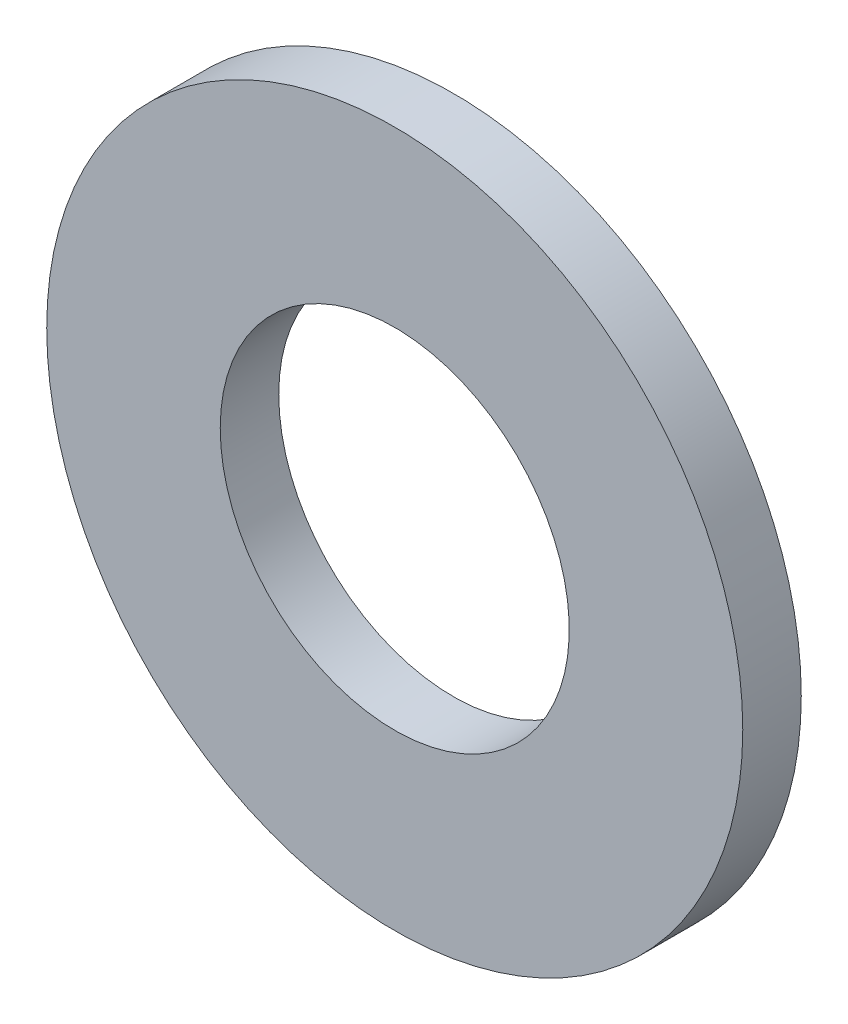
ISO-10303-21;
HEADER;
FILE_DESCRIPTION(('STEP AP214'),'2;1');
FILE_NAME('part.step','',(''),(''),'','','');
FILE_SCHEMA(('AUTOMOTIVE_DESIGN { 1 0 10303 214 1 1 1 1 }'));
ENDSEC;
DATA;
#1=APPLICATION_CONTEXT('core data for automotive mechanical design processes');
#2=APPLICATION_PROTOCOL_DEFINITION('international standard','automotive_design',2000,#1);
#3=PRODUCT_CONTEXT('',#1,'mechanical');
#4=PRODUCT('Part','Part','',(#3));
#5=PRODUCT_RELATED_PRODUCT_CATEGORY('part','',(#4));
#6=PRODUCT_DEFINITION_FORMATION('','',#4);
#7=PRODUCT_DEFINITION_CONTEXT('part definition',#1,'design');
#8=PRODUCT_DEFINITION('design','',#6,#7);
#9=PRODUCT_DEFINITION_SHAPE('','',#8);
#10=(LENGTH_UNIT() NAMED_UNIT(*) SI_UNIT(.MILLI.,.METRE.));
#11=(NAMED_UNIT(*) PLANE_ANGLE_UNIT() SI_UNIT($,.RADIAN.));
#12=(NAMED_UNIT(*) SI_UNIT($,.STERADIAN.) SOLID_ANGLE_UNIT());
#13=UNCERTAINTY_MEASURE_WITH_UNIT(LENGTH_MEASURE(1.E-05),#10,'distance_accuracy_value','');
#14=(GEOMETRIC_REPRESENTATION_CONTEXT(3) GLOBAL_UNCERTAINTY_ASSIGNED_CONTEXT((#13)) GLOBAL_UNIT_ASSIGNED_CONTEXT((#10,
#11,#12)) REPRESENTATION_CONTEXT('',''));
#15=CARTESIAN_POINT('',(0.,0.,0.));
#16=DIRECTION('',(0.,0.,1.));
#17=DIRECTION('',(1.,0.,0.));
#18=AXIS2_PLACEMENT_3D('',#15,#16,#17);
#19=CARTESIAN_POINT('',(0.,0.,0.));
#20=DIRECTION('',(0.,0.,-1.));
#21=DIRECTION('',(-1.,0.,0.));
#22=AXIS2_PLACEMENT_3D('',#19,#20,#21);
#23=PLANE('',#22);
#24=CARTESIAN_POINT('',(0.,0.,0.));
#25=DIRECTION('',(0.,0.,-1.));
#26=DIRECTION('',(-1.,0.,0.));
#27=AXIS2_PLACEMENT_3D('',#24,#25,#26);
#28=CIRCLE('',#27,8.763);
#29=CARTESIAN_POINT('',(-8.763,0.,0.));
#30=VERTEX_POINT('',#29);
#31=EDGE_CURVE('E30',#30,#30,#28,.F.);
#32=ORIENTED_EDGE('',*,*,#31,.F.);
#33=EDGE_LOOP('',(#32));
#34=FACE_BOUND('',#33,.T.);
#35=CARTESIAN_POINT('',(0.,0.,0.));
#36=DIRECTION('',(0.,0.,-1.));
#37=DIRECTION('',(-1.,0.,0.));
#38=AXIS2_PLACEMENT_3D('',#35,#36,#37);
#39=CIRCLE('',#38,4.3942);
#40=CARTESIAN_POINT('',(-4.3942,0.,0.));
#41=VERTEX_POINT('',#40);
#42=EDGE_CURVE('E17',#41,#41,#39,.F.);
#43=ORIENTED_EDGE('',*,*,#42,.T.);
#44=EDGE_LOOP('',(#43));
#45=FACE_BOUND('',#44,.T.);
#46=ADVANCED_FACE('F14',(#34,#45),#23,.T.);
#47=CARTESIAN_POINT('',(0.,0.,1.4732));
#48=DIRECTION('',(0.,0.,-1.));
#49=DIRECTION('',(-1.,0.,0.));
#50=AXIS2_PLACEMENT_3D('',#47,#48,#49);
#51=CYLINDRICAL_SURFACE('',#50,4.3942);
#52=CARTESIAN_POINT('',(0.,0.,1.4732));
#53=DIRECTION('',(0.,0.,-1.));
#54=DIRECTION('',(-1.,0.,0.));
#55=AXIS2_PLACEMENT_3D('',#52,#53,#54);
#56=CIRCLE('',#55,4.3942);
#57=CARTESIAN_POINT('',(-4.3942,0.,1.4732));
#58=VERTEX_POINT('',#57);
#59=EDGE_CURVE('E22',#58,#58,#56,.F.);
#60=ORIENTED_EDGE('',*,*,#59,.T.);
#61=EDGE_LOOP('',(#60));
#62=FACE_BOUND('',#61,.T.);
#63=ORIENTED_EDGE('',*,*,#42,.F.);
#64=EDGE_LOOP('',(#63));
#65=FACE_BOUND('',#64,.T.);
#66=ADVANCED_FACE('F40',(#62,#65),#51,.F.);
#67=CARTESIAN_POINT('',(0.,0.,1.4732));
#68=DIRECTION('',(0.,0.,-1.));
#69=DIRECTION('',(-1.,0.,0.));
#70=AXIS2_PLACEMENT_3D('',#67,#68,#69);
#71=CYLINDRICAL_SURFACE('',#70,8.763);
#72=ORIENTED_EDGE('',*,*,#31,.T.);
#73=EDGE_LOOP('',(#72));
#74=FACE_BOUND('',#73,.T.);
#75=CARTESIAN_POINT('',(0.,0.,1.4732));
#76=DIRECTION('',(0.,0.,-1.));
#77=DIRECTION('',(-1.,0.,0.));
#78=AXIS2_PLACEMENT_3D('',#75,#76,#77);
#79=CIRCLE('',#78,8.763);
#80=CARTESIAN_POINT('',(-8.763,0.,1.4732));
#81=VERTEX_POINT('',#80);
#82=EDGE_CURVE('E10',#81,#81,#79,.T.);
#83=ORIENTED_EDGE('',*,*,#82,.T.);
#84=EDGE_LOOP('',(#83));
#85=FACE_BOUND('',#84,.T.);
#86=ADVANCED_FACE('F42',(#74,#85),#71,.T.);
#87=CARTESIAN_POINT('',(0.,0.,1.4732));
#88=DIRECTION('',(0.,0.,-1.));
#89=DIRECTION('',(-1.,0.,0.));
#90=AXIS2_PLACEMENT_3D('',#87,#88,#89);
#91=PLANE('',#90);
#92=ORIENTED_EDGE('',*,*,#82,.F.);
#93=EDGE_LOOP('',(#92));
#94=FACE_BOUND('',#93,.T.);
#95=ORIENTED_EDGE('',*,*,#59,.F.);
#96=EDGE_LOOP('',(#95));
#97=FACE_BOUND('',#96,.T.);
#98=ADVANCED_FACE('F49',(#94,#97),#91,.F.);
#99=CLOSED_SHELL('',(#46,#66,#86,#98));
#100=MANIFOLD_SOLID_BREP('B1',#99);
#101=ADVANCED_BREP_SHAPE_REPRESENTATION('',(#18,#100),#14);
#102=SHAPE_DEFINITION_REPRESENTATION(#9,#101);
ENDSEC;
END-ISO-10303-21;
